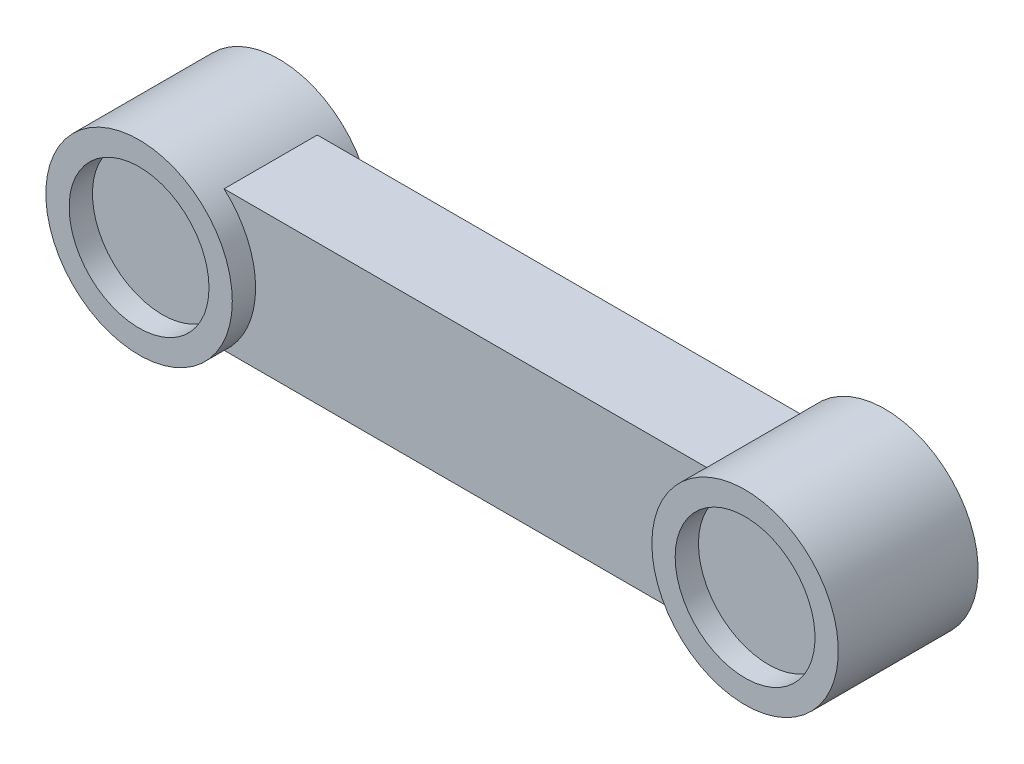
ISO-10303-21;
HEADER;
FILE_DESCRIPTION(('STEP AP214'),'2;1');
FILE_NAME('part.step','',(''),(''),'','','');
FILE_SCHEMA(('AUTOMOTIVE_DESIGN { 1 0 10303 214 1 1 1 1 }'));
ENDSEC;
DATA;
#1=APPLICATION_CONTEXT('core data for automotive mechanical design processes');
#2=APPLICATION_PROTOCOL_DEFINITION('international standard','automotive_design',2000,#1);
#3=PRODUCT_CONTEXT('',#1,'mechanical');
#4=PRODUCT('Part','Part','',(#3));
#5=PRODUCT_RELATED_PRODUCT_CATEGORY('part','',(#4));
#6=PRODUCT_DEFINITION_FORMATION('','',#4);
#7=PRODUCT_DEFINITION_CONTEXT('part definition',#1,'design');
#8=PRODUCT_DEFINITION('design','',#6,#7);
#9=PRODUCT_DEFINITION_SHAPE('','',#8);
#10=(LENGTH_UNIT() NAMED_UNIT(*) SI_UNIT(.MILLI.,.METRE.));
#11=(NAMED_UNIT(*) PLANE_ANGLE_UNIT() SI_UNIT($,.RADIAN.));
#12=(NAMED_UNIT(*) SI_UNIT($,.STERADIAN.) SOLID_ANGLE_UNIT());
#13=UNCERTAINTY_MEASURE_WITH_UNIT(LENGTH_MEASURE(1.E-05),#10,'distance_accuracy_value','');
#14=(GEOMETRIC_REPRESENTATION_CONTEXT(3) GLOBAL_UNCERTAINTY_ASSIGNED_CONTEXT((#13)) GLOBAL_UNIT_ASSIGNED_CONTEXT((#10,
#11,#12)) REPRESENTATION_CONTEXT('',''));
#15=CARTESIAN_POINT('',(0.,0.,0.));
#16=DIRECTION('',(0.,0.,1.));
#17=DIRECTION('',(1.,0.,0.));
#18=AXIS2_PLACEMENT_3D('',#15,#16,#17);
#19=CARTESIAN_POINT('',(300.001000000001,29.9999999999979,50.0000000000011));
#20=DIRECTION('',(0.,0.,1.));
#21=DIRECTION('',(1.,0.,0.));
#22=AXIS2_PLACEMENT_3D('',#19,#20,#21);
#23=PLANE('',#22);
#24=DIRECTION('',(1.,0.,0.));
#25=VECTOR('',#24,1.);
#26=CARTESIAN_POINT('',(-40.0010000000006,-29.9999999999997,49.9999999999999));
#27=LINE('',#26,#25);
#28=CARTESIAN_POINT('',(26.4575131106457,-30.0000000000002,50.0000000000008));
#29=VERTEX_POINT('',#28);
#30=CARTESIAN_POINT('',(233.542486889356,-30.0000000000016,50.0000000000008));
#31=VERTEX_POINT('',#30);
#32=EDGE_CURVE('E57',#29,#31,#27,.T.);
#33=ORIENTED_EDGE('',*,*,#32,.T.);
#34=CARTESIAN_POINT('',(260.,0.,50.0000000000009));
#35=DIRECTION('',(0.,0.,1.));
#36=DIRECTION('',(1.,0.,0.));
#37=AXIS2_PLACEMENT_3D('',#34,#35,#36);
#38=CIRCLE('',#37,40.);
#39=CARTESIAN_POINT('',(233.542486889352,29.9999999999984,50.0000000000008));
#40=VERTEX_POINT('',#39);
#41=EDGE_CURVE('E105',#31,#40,#38,.F.);
#42=ORIENTED_EDGE('',*,*,#41,.T.);
#43=DIRECTION('',(1.,0.,0.));
#44=VECTOR('',#43,1.);
#45=CARTESIAN_POINT('',(-40.0010000000002,30.0000000000003,49.9999999999999));
#46=LINE('',#45,#44);
#47=CARTESIAN_POINT('',(26.4575131106461,29.9999999999998,50.0000000000001));
#48=VERTEX_POINT('',#47);
#49=EDGE_CURVE('E131',#48,#40,#46,.T.);
#50=ORIENTED_EDGE('',*,*,#49,.F.);
#51=CARTESIAN_POINT('',(0.,0.,50.));
#52=DIRECTION('',(0.,0.,-1.));
#53=DIRECTION('',(-1.,0.,0.));
#54=AXIS2_PLACEMENT_3D('',#51,#52,#53);
#55=CIRCLE('',#54,40.);
#56=EDGE_CURVE('E94',#29,#48,#55,.F.);
#57=ORIENTED_EDGE('',*,*,#56,.F.);
#58=EDGE_LOOP('',(#33,#42,#50,#57));
#59=FACE_BOUND('',#58,.T.);
#60=ADVANCED_FACE('F39',(#59),#23,.T.);
#61=CARTESIAN_POINT('',(0.,0.,60.));
#62=DIRECTION('',(0.,0.,-1.));
#63=DIRECTION('',(-1.,0.,0.));
#64=AXIS2_PLACEMENT_3D('',#61,#62,#63);
#65=CYLINDRICAL_SURFACE('',#64,40.);
#66=CARTESIAN_POINT('',(0.,0.,0.));
#67=DIRECTION('',(0.,0.,1.));
#68=DIRECTION('',(1.,0.,0.));
#69=AXIS2_PLACEMENT_3D('',#66,#67,#68);
#70=CIRCLE('',#69,40.);
#71=CARTESIAN_POINT('',(40.,0.,0.));
#72=VERTEX_POINT('',#71);
#73=EDGE_CURVE('E43',#72,#72,#70,.T.);
#74=ORIENTED_EDGE('',*,*,#73,.T.);
#75=EDGE_LOOP('',(#74));
#76=FACE_BOUND('',#75,.T.);
#77=CARTESIAN_POINT('',(0.,0.,60.));
#78=DIRECTION('',(0.,0.,1.));
#79=DIRECTION('',(1.,0.,0.));
#80=AXIS2_PLACEMENT_3D('',#77,#78,#79);
#81=CIRCLE('',#80,40.);
#82=CARTESIAN_POINT('',(40.,0.,60.));
#83=VERTEX_POINT('',#82);
#84=EDGE_CURVE('E49',#83,#83,#81,.T.);
#85=ORIENTED_EDGE('',*,*,#84,.F.);
#86=EDGE_LOOP('',(#85));
#87=FACE_BOUND('',#86,.T.);
#88=DIRECTION('',(0.,0.,-1.));
#89=VECTOR('',#88,1.);
#90=CARTESIAN_POINT('',(26.4575131106461,29.9999999999998,60.));
#91=LINE('',#90,#89);
#92=CARTESIAN_POINT('',(26.4575131106461,29.9999999999998,10.0000000000001));
#93=VERTEX_POINT('',#92);
#94=EDGE_CURVE('E65',#48,#93,#91,.T.);
#95=ORIENTED_EDGE('',*,*,#94,.T.);
#96=CARTESIAN_POINT('',(0.,0.,9.99999999999999));
#97=DIRECTION('',(0.,0.,1.));
#98=DIRECTION('',(1.,0.,0.));
#99=AXIS2_PLACEMENT_3D('',#96,#97,#98);
#100=CIRCLE('',#99,40.);
#101=CARTESIAN_POINT('',(26.4575131106457,-30.0000000000002,10.0000000000001));
#102=VERTEX_POINT('',#101);
#103=EDGE_CURVE('E140',#93,#102,#100,.F.);
#104=ORIENTED_EDGE('',*,*,#103,.T.);
#105=DIRECTION('',(0.,0.,-1.));
#106=VECTOR('',#105,1.);
#107=CARTESIAN_POINT('',(26.4575131106457,-30.0000000000002,60.));
#108=LINE('',#107,#106);
#109=EDGE_CURVE('E91',#102,#29,#108,.F.);
#110=ORIENTED_EDGE('',*,*,#109,.T.);
#111=ORIENTED_EDGE('',*,*,#56,.T.);
#112=EDGE_LOOP('',(#95,#104,#110,#111));
#113=FACE_BOUND('',#112,.T.);
#114=ADVANCED_FACE('F41',(#76,#87,#113),#65,.T.);
#115=CARTESIAN_POINT('',(0.,0.,60.));
#116=DIRECTION('',(0.,0.,1.));
#117=DIRECTION('',(1.,0.,0.));
#118=AXIS2_PLACEMENT_3D('',#115,#116,#117);
#119=PLANE('',#118);
#120=CARTESIAN_POINT('',(0.,0.,60.));
#121=DIRECTION('',(0.,0.,1.));
#122=DIRECTION('',(1.,0.,0.));
#123=AXIS2_PLACEMENT_3D('',#120,#121,#122);
#124=CIRCLE('',#123,30.);
#125=CARTESIAN_POINT('',(30.,0.,60.));
#126=VERTEX_POINT('',#125);
#127=EDGE_CURVE('E285',#126,#126,#124,.T.);
#128=ORIENTED_EDGE('',*,*,#127,.F.);
#129=EDGE_LOOP('',(#128));
#130=FACE_BOUND('',#129,.T.);
#131=ORIENTED_EDGE('',*,*,#84,.T.);
#132=EDGE_LOOP('',(#131));
#133=FACE_BOUND('',#132,.T.);
#134=ADVANCED_FACE('F158',(#130,#133),#119,.T.);
#135=CARTESIAN_POINT('',(0.,0.,0.));
#136=DIRECTION('',(0.,0.,1.));
#137=DIRECTION('',(1.,0.,0.));
#138=AXIS2_PLACEMENT_3D('',#135,#136,#137);
#139=PLANE('',#138);
#140=CARTESIAN_POINT('',(0.,0.,0.));
#141=DIRECTION('',(0.,0.,-1.));
#142=DIRECTION('',(-1.,0.,0.));
#143=AXIS2_PLACEMENT_3D('',#140,#141,#142);
#144=CIRCLE('',#143,6.);
#145=CARTESIAN_POINT('',(-6.,0.,0.));
#146=VERTEX_POINT('',#145);
#147=EDGE_CURVE('E118',#146,#146,#144,.T.);
#148=ORIENTED_EDGE('',*,*,#147,.F.);
#149=EDGE_LOOP('',(#148));
#150=FACE_BOUND('',#149,.T.);
#151=ORIENTED_EDGE('',*,*,#73,.F.);
#152=EDGE_LOOP('',(#151));
#153=FACE_BOUND('',#152,.T.);
#154=ADVANCED_FACE('F156',(#150,#153),#139,.F.);
#155=CARTESIAN_POINT('',(300.001000000001,29.9999999999979,10.0000000000011));
#156=DIRECTION('',(0.,0.,-1.));
#157=DIRECTION('',(-1.,0.,0.));
#158=AXIS2_PLACEMENT_3D('',#155,#156,#157);
#159=PLANE('',#158);
#160=DIRECTION('',(1.,0.,0.));
#161=VECTOR('',#160,1.);
#162=CARTESIAN_POINT('',(-40.0010000000001,30.0000000000003,9.99999999999985));
#163=LINE('',#162,#161);
#164=CARTESIAN_POINT('',(233.542486889352,29.9999999999984,10.0000000000008));
#165=VERTEX_POINT('',#164);
#166=EDGE_CURVE('E95',#93,#165,#163,.T.);
#167=ORIENTED_EDGE('',*,*,#166,.T.);
#168=CARTESIAN_POINT('',(260.,0.,10.0000000000009));
#169=DIRECTION('',(0.,0.,-1.));
#170=DIRECTION('',(-1.,0.,0.));
#171=AXIS2_PLACEMENT_3D('',#168,#169,#170);
#172=CIRCLE('',#171,40.);
#173=CARTESIAN_POINT('',(233.542486889356,-30.0000000000016,10.0000000000008));
#174=VERTEX_POINT('',#173);
#175=EDGE_CURVE('E98',#165,#174,#172,.F.);
#176=ORIENTED_EDGE('',*,*,#175,.T.);
#177=DIRECTION('',(1.,0.,0.));
#178=VECTOR('',#177,1.);
#179=CARTESIAN_POINT('',(-40.0010000000005,-29.9999999999997,9.99999999999986));
#180=LINE('',#179,#178);
#181=EDGE_CURVE('E86',#102,#174,#180,.T.);
#182=ORIENTED_EDGE('',*,*,#181,.F.);
#183=ORIENTED_EDGE('',*,*,#103,.F.);
#184=EDGE_LOOP('',(#167,#176,#182,#183));
#185=FACE_BOUND('',#184,.T.);
#186=ADVANCED_FACE('F99',(#185),#159,.T.);
#187=CARTESIAN_POINT('',(-40.0010000000001,30.0000000000003,9.99999999999985));
#188=DIRECTION('',(0.,-1.,0.));
#189=DIRECTION('',(1.,0.,0.));
#190=AXIS2_PLACEMENT_3D('',#187,#188,#189);
#191=PLANE('',#190);
#192=ORIENTED_EDGE('',*,*,#94,.F.);
#193=ORIENTED_EDGE('',*,*,#49,.T.);
#194=DIRECTION('',(0.,0.,-1.));
#195=VECTOR('',#194,1.);
#196=CARTESIAN_POINT('',(233.542486889352,29.9999999999984,60.));
#197=LINE('',#196,#195);
#198=EDGE_CURVE('E110',#40,#165,#197,.T.);
#199=ORIENTED_EDGE('',*,*,#198,.T.);
#200=ORIENTED_EDGE('',*,*,#166,.F.);
#201=EDGE_LOOP('',(#192,#193,#199,#200));
#202=FACE_BOUND('',#201,.T.);
#203=ADVANCED_FACE('F164',(#202),#191,.F.);
#204=CARTESIAN_POINT('',(-40.0010000000005,-29.9999999999997,9.99999999999986));
#205=DIRECTION('',(0.,1.,0.));
#206=DIRECTION('',(-1.,0.,0.));
#207=AXIS2_PLACEMENT_3D('',#204,#205,#206);
#208=PLANE('',#207);
#209=ORIENTED_EDGE('',*,*,#109,.F.);
#210=ORIENTED_EDGE('',*,*,#181,.T.);
#211=DIRECTION('',(0.,0.,-1.));
#212=VECTOR('',#211,1.);
#213=CARTESIAN_POINT('',(233.542486889356,-30.0000000000016,60.));
#214=LINE('',#213,#212);
#215=EDGE_CURVE('E90',#174,#31,#214,.F.);
#216=ORIENTED_EDGE('',*,*,#215,.T.);
#217=ORIENTED_EDGE('',*,*,#32,.F.);
#218=EDGE_LOOP('',(#209,#210,#216,#217));
#219=FACE_BOUND('',#218,.T.);
#220=ADVANCED_FACE('F88',(#219),#208,.F.);
#221=CARTESIAN_POINT('',(260.,0.,60.));
#222=DIRECTION('',(0.,0.,-1.));
#223=DIRECTION('',(-1.,0.,0.));
#224=AXIS2_PLACEMENT_3D('',#221,#222,#223);
#225=PLANE('',#224);
#226=CARTESIAN_POINT('',(260.,0.,60.));
#227=DIRECTION('',(0.,0.,1.));
#228=DIRECTION('',(-1.,0.,0.));
#229=AXIS2_PLACEMENT_3D('',#226,#227,#228);
#230=CIRCLE('',#229,30.);
#231=CARTESIAN_POINT('',(230.,0.,60.));
#232=VERTEX_POINT('',#231);
#233=EDGE_CURVE('E288',#232,#232,#230,.T.);
#234=ORIENTED_EDGE('',*,*,#233,.F.);
#235=EDGE_LOOP('',(#234));
#236=FACE_BOUND('',#235,.T.);
#237=CARTESIAN_POINT('',(260.,0.,60.));
#238=DIRECTION('',(0.,0.,1.));
#239=DIRECTION('',(-1.,0.,0.));
#240=AXIS2_PLACEMENT_3D('',#237,#238,#239);
#241=CIRCLE('',#240,40.);
#242=CARTESIAN_POINT('',(220.,0.,60.));
#243=VERTEX_POINT('',#242);
#244=EDGE_CURVE('E122',#243,#243,#241,.T.);
#245=ORIENTED_EDGE('',*,*,#244,.T.);
#246=EDGE_LOOP('',(#245));
#247=FACE_BOUND('',#246,.T.);
#248=ADVANCED_FACE('F187',(#236,#247),#225,.F.);
#249=CARTESIAN_POINT('',(260.,0.,0.));
#250=DIRECTION('',(0.,0.,-1.));
#251=DIRECTION('',(-1.,0.,0.));
#252=AXIS2_PLACEMENT_3D('',#249,#250,#251);
#253=PLANE('',#252);
#254=CARTESIAN_POINT('',(260.,0.,0.));
#255=DIRECTION('',(0.,0.,-1.));
#256=DIRECTION('',(-1.,0.,0.));
#257=AXIS2_PLACEMENT_3D('',#254,#255,#256);
#258=CIRCLE('',#257,5.99999999999999);
#259=CARTESIAN_POINT('',(254.,0.,0.));
#260=VERTEX_POINT('',#259);
#261=EDGE_CURVE('E11',#260,#260,#258,.T.);
#262=ORIENTED_EDGE('',*,*,#261,.F.);
#263=EDGE_LOOP('',(#262));
#264=FACE_BOUND('',#263,.T.);
#265=CARTESIAN_POINT('',(260.,0.,0.));
#266=DIRECTION('',(0.,0.,1.));
#267=DIRECTION('',(-1.,0.,0.));
#268=AXIS2_PLACEMENT_3D('',#265,#266,#267);
#269=CIRCLE('',#268,40.);
#270=CARTESIAN_POINT('',(220.,0.,0.));
#271=VERTEX_POINT('',#270);
#272=EDGE_CURVE('E115',#271,#271,#269,.T.);
#273=ORIENTED_EDGE('',*,*,#272,.F.);
#274=EDGE_LOOP('',(#273));
#275=FACE_BOUND('',#274,.T.);
#276=ADVANCED_FACE('F179',(#264,#275),#253,.T.);
#277=CARTESIAN_POINT('',(260.,0.,60.));
#278=DIRECTION('',(0.,0.,-1.));
#279=DIRECTION('',(-1.,0.,0.));
#280=AXIS2_PLACEMENT_3D('',#277,#278,#279);
#281=CYLINDRICAL_SURFACE('',#280,40.);
#282=ORIENTED_EDGE('',*,*,#215,.F.);
#283=ORIENTED_EDGE('',*,*,#175,.F.);
#284=ORIENTED_EDGE('',*,*,#198,.F.);
#285=ORIENTED_EDGE('',*,*,#41,.F.);
#286=EDGE_LOOP('',(#282,#283,#284,#285));
#287=FACE_BOUND('',#286,.T.);
#288=ORIENTED_EDGE('',*,*,#244,.F.);
#289=EDGE_LOOP('',(#288));
#290=FACE_BOUND('',#289,.T.);
#291=ORIENTED_EDGE('',*,*,#272,.T.);
#292=EDGE_LOOP('',(#291));
#293=FACE_BOUND('',#292,.T.);
#294=ADVANCED_FACE('F107',(#287,#290,#293),#281,.T.);
#295=CARTESIAN_POINT('',(0.,0.,10.));
#296=DIRECTION('',(0.,0.,-1.));
#297=DIRECTION('',(-1.,0.,0.));
#298=AXIS2_PLACEMENT_3D('',#295,#296,#297);
#299=CYLINDRICAL_SURFACE('',#298,6.);
#300=CARTESIAN_POINT('',(0.,0.,10.));
#301=DIRECTION('',(0.,0.,-1.));
#302=DIRECTION('',(-1.,0.,0.));
#303=AXIS2_PLACEMENT_3D('',#300,#301,#302);
#304=CIRCLE('',#303,6.);
#305=CARTESIAN_POINT('',(-6.,0.,10.));
#306=VERTEX_POINT('',#305);
#307=EDGE_CURVE('E111',#306,#306,#304,.T.);
#308=ORIENTED_EDGE('',*,*,#307,.F.);
#309=EDGE_LOOP('',(#308));
#310=FACE_BOUND('',#309,.T.);
#311=ORIENTED_EDGE('',*,*,#147,.T.);
#312=EDGE_LOOP('',(#311));
#313=FACE_BOUND('',#312,.T.);
#314=ADVANCED_FACE('F178',(#310,#313),#299,.F.);
#315=CARTESIAN_POINT('',(0.,0.,10.));
#316=DIRECTION('',(0.,0.,-1.));
#317=DIRECTION('',(-1.,0.,0.));
#318=AXIS2_PLACEMENT_3D('',#315,#316,#317);
#319=PLANE('',#318);
#320=ORIENTED_EDGE('',*,*,#307,.T.);
#321=EDGE_LOOP('',(#320));
#322=FACE_BOUND('',#321,.T.);
#323=ADVANCED_FACE('F184',(#322),#319,.T.);
#324=CARTESIAN_POINT('',(260.,0.,-10.));
#325=DIRECTION('',(0.,0.,1.));
#326=DIRECTION('',(1.,0.,0.));
#327=AXIS2_PLACEMENT_3D('',#324,#325,#326);
#328=CYLINDRICAL_SURFACE('',#327,5.99999999999999);
#329=CARTESIAN_POINT('',(260.,0.,-10.));
#330=DIRECTION('',(0.,0.,-1.));
#331=DIRECTION('',(-1.,0.,0.));
#332=AXIS2_PLACEMENT_3D('',#329,#330,#331);
#333=CIRCLE('',#332,5.99999999999999);
#334=CARTESIAN_POINT('',(254.,0.,-10.));
#335=VERTEX_POINT('',#334);
#336=EDGE_CURVE('E278',#335,#335,#333,.T.);
#337=ORIENTED_EDGE('',*,*,#336,.F.);
#338=EDGE_LOOP('',(#337));
#339=FACE_BOUND('',#338,.T.);
#340=ORIENTED_EDGE('',*,*,#261,.T.);
#341=EDGE_LOOP('',(#340));
#342=FACE_BOUND('',#341,.T.);
#343=ADVANCED_FACE('F265',(#339,#342),#328,.T.);
#344=CARTESIAN_POINT('',(260.,0.,-10.));
#345=DIRECTION('',(0.,0.,-1.));
#346=DIRECTION('',(-1.,0.,0.));
#347=AXIS2_PLACEMENT_3D('',#344,#345,#346);
#348=PLANE('',#347);
#349=ORIENTED_EDGE('',*,*,#336,.T.);
#350=EDGE_LOOP('',(#349));
#351=FACE_BOUND('',#350,.T.);
#352=ADVANCED_FACE('F226',(#351),#348,.T.);
#353=CARTESIAN_POINT('',(260.,0.,50.));
#354=DIRECTION('',(0.,0.,1.));
#355=DIRECTION('',(1.,0.,0.));
#356=AXIS2_PLACEMENT_3D('',#353,#354,#355);
#357=CYLINDRICAL_SURFACE('',#356,30.);
#358=CARTESIAN_POINT('',(260.,0.,50.));
#359=DIRECTION('',(0.,0.,1.));
#360=DIRECTION('',(-1.,0.,0.));
#361=AXIS2_PLACEMENT_3D('',#358,#359,#360);
#362=CIRCLE('',#361,30.);
#363=CARTESIAN_POINT('',(230.,0.,50.));
#364=VERTEX_POINT('',#363);
#365=EDGE_CURVE('E292',#364,#364,#362,.T.);
#366=ORIENTED_EDGE('',*,*,#365,.F.);
#367=EDGE_LOOP('',(#366));
#368=FACE_BOUND('',#367,.T.);
#369=ORIENTED_EDGE('',*,*,#233,.T.);
#370=EDGE_LOOP('',(#369));
#371=FACE_BOUND('',#370,.T.);
#372=ADVANCED_FACE('F220',(#368,#371),#357,.F.);
#373=CARTESIAN_POINT('',(260.,0.,50.));
#374=DIRECTION('',(0.,0.,-1.));
#375=DIRECTION('',(-1.,0.,0.));
#376=AXIS2_PLACEMENT_3D('',#373,#374,#375);
#377=PLANE('',#376);
#378=ORIENTED_EDGE('',*,*,#365,.T.);
#379=EDGE_LOOP('',(#378));
#380=FACE_BOUND('',#379,.T.);
#381=ADVANCED_FACE('F225',(#380),#377,.F.);
#382=CARTESIAN_POINT('',(0.,0.,50.));
#383=DIRECTION('',(0.,0.,1.));
#384=DIRECTION('',(1.,0.,0.));
#385=AXIS2_PLACEMENT_3D('',#382,#383,#384);
#386=CYLINDRICAL_SURFACE('',#385,30.);
#387=CARTESIAN_POINT('',(0.,0.,50.));
#388=DIRECTION('',(0.,0.,1.));
#389=DIRECTION('',(1.,0.,0.));
#390=AXIS2_PLACEMENT_3D('',#387,#388,#389);
#391=CIRCLE('',#390,30.);
#392=CARTESIAN_POINT('',(30.,0.,50.));
#393=VERTEX_POINT('',#392);
#394=EDGE_CURVE('E281',#393,#393,#391,.T.);
#395=ORIENTED_EDGE('',*,*,#394,.F.);
#396=EDGE_LOOP('',(#395));
#397=FACE_BOUND('',#396,.T.);
#398=ORIENTED_EDGE('',*,*,#127,.T.);
#399=EDGE_LOOP('',(#398));
#400=FACE_BOUND('',#399,.T.);
#401=ADVANCED_FACE('F238',(#397,#400),#386,.F.);
#402=CARTESIAN_POINT('',(0.,0.,50.));
#403=DIRECTION('',(0.,0.,1.));
#404=DIRECTION('',(1.,0.,0.));
#405=AXIS2_PLACEMENT_3D('',#402,#403,#404);
#406=PLANE('',#405);
#407=ORIENTED_EDGE('',*,*,#394,.T.);
#408=EDGE_LOOP('',(#407));
#409=FACE_BOUND('',#408,.T.);
#410=ADVANCED_FACE('F248',(#409),#406,.T.);
#411=CLOSED_SHELL('',(#60,#114,#134,#154,#186,#203,#220,#248,#276,#294,#314,#323,#343,#352,#372,
#381,#401,#410));
#412=MANIFOLD_SOLID_BREP('B2',#411);
#413=ADVANCED_BREP_SHAPE_REPRESENTATION('',(#18,#412),#14);
#414=SHAPE_DEFINITION_REPRESENTATION(#9,#413);
ENDSEC;
END-ISO-10303-21;
